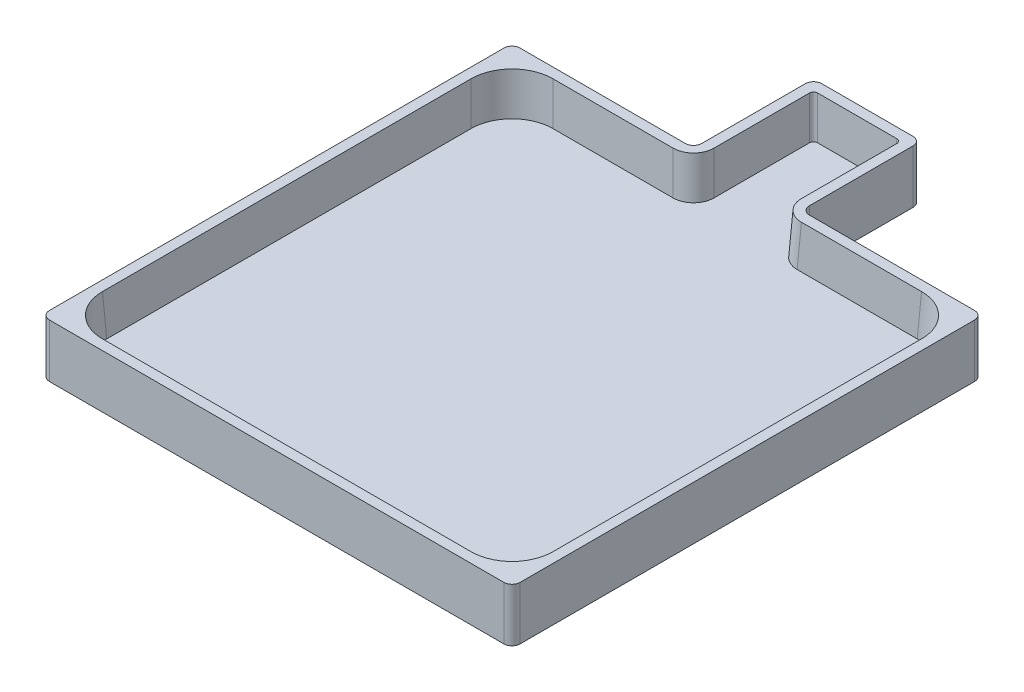
ISO-10303-21;
HEADER;
FILE_DESCRIPTION(('STEP AP214'),'2;1');
FILE_NAME('part.step','',(''),(''),'','','');
FILE_SCHEMA(('AUTOMOTIVE_DESIGN { 1 0 10303 214 1 1 1 1 }'));
ENDSEC;
DATA;
#1=APPLICATION_CONTEXT('core data for automotive mechanical design processes');
#2=APPLICATION_PROTOCOL_DEFINITION('international standard','automotive_design',2000,#1);
#3=PRODUCT_CONTEXT('',#1,'mechanical');
#4=PRODUCT('Part','Part','',(#3));
#5=PRODUCT_RELATED_PRODUCT_CATEGORY('part','',(#4));
#6=PRODUCT_DEFINITION_FORMATION('','',#4);
#7=PRODUCT_DEFINITION_CONTEXT('part definition',#1,'design');
#8=PRODUCT_DEFINITION('design','',#6,#7);
#9=PRODUCT_DEFINITION_SHAPE('','',#8);
#10=(LENGTH_UNIT() NAMED_UNIT(*) SI_UNIT(.MILLI.,.METRE.));
#11=(NAMED_UNIT(*) PLANE_ANGLE_UNIT() SI_UNIT($,.RADIAN.));
#12=(NAMED_UNIT(*) SI_UNIT($,.STERADIAN.) SOLID_ANGLE_UNIT());
#13=UNCERTAINTY_MEASURE_WITH_UNIT(LENGTH_MEASURE(1.E-05),#10,'distance_accuracy_value','');
#14=(GEOMETRIC_REPRESENTATION_CONTEXT(3) GLOBAL_UNCERTAINTY_ASSIGNED_CONTEXT((#13)) GLOBAL_UNIT_ASSIGNED_CONTEXT((#10,
#11,#12)) REPRESENTATION_CONTEXT('',''));
#15=CARTESIAN_POINT('',(0.,0.,0.));
#16=DIRECTION('',(0.,0.,1.));
#17=DIRECTION('',(1.,0.,0.));
#18=AXIS2_PLACEMENT_3D('',#15,#16,#17);
#19=CARTESIAN_POINT('',(-57.4,3.,0.));
#20=DIRECTION('',(1.,0.,0.));
#21=DIRECTION('',(0.,0.,-1.));
#22=AXIS2_PLACEMENT_3D('',#19,#20,#21);
#23=PLANE('',#22);
#24=DIRECTION('',(0.,0.,-1.));
#25=VECTOR('',#24,1.);
#26=CARTESIAN_POINT('',(-57.4,13.,0.));
#27=LINE('',#26,#25);
#28=CARTESIAN_POINT('',(-57.4,13.,55.4));
#29=VERTEX_POINT('',#28);
#30=CARTESIAN_POINT('',(-57.3999999999999,13.,-55.4));
#31=VERTEX_POINT('',#30);
#32=EDGE_CURVE('E484',#29,#31,#27,.T.);
#33=ORIENTED_EDGE('',*,*,#32,.T.);
#34=DIRECTION('',(0.,-1.,0.));
#35=VECTOR('',#34,1.);
#36=CARTESIAN_POINT('',(-57.4,3.,-55.4));
#37=LINE('',#36,#35);
#38=CARTESIAN_POINT('',(-57.4,0.,-55.4));
#39=VERTEX_POINT('',#38);
#40=EDGE_CURVE('E331',#31,#39,#37,.T.);
#41=ORIENTED_EDGE('',*,*,#40,.T.);
#42=DIRECTION('',(0.,0.,1.));
#43=VECTOR('',#42,1.);
#44=CARTESIAN_POINT('',(-57.4,0.,0.));
#45=LINE('',#44,#43);
#46=CARTESIAN_POINT('',(-57.4,0.,55.4));
#47=VERTEX_POINT('',#46);
#48=EDGE_CURVE('E487',#39,#47,#45,.T.);
#49=ORIENTED_EDGE('',*,*,#48,.T.);
#50=DIRECTION('',(0.,-1.,0.));
#51=VECTOR('',#50,1.);
#52=CARTESIAN_POINT('',(-57.4,3.,55.4));
#53=LINE('',#52,#51);
#54=EDGE_CURVE('E329',#47,#29,#53,.F.);
#55=ORIENTED_EDGE('',*,*,#54,.T.);
#56=EDGE_LOOP('',(#33,#41,#49,#55));
#57=FACE_BOUND('',#56,.T.);
#58=ADVANCED_FACE('F44',(#57),#23,.F.);
#59=CARTESIAN_POINT('',(-1.5318942695549E-13,3.,57.4000000000001));
#60=DIRECTION('',(0.,0.,-1.));
#61=DIRECTION('',(-1.,0.,0.));
#62=AXIS2_PLACEMENT_3D('',#59,#60,#61);
#63=PLANE('',#62);
#64=DIRECTION('',(1.,0.,0.));
#65=VECTOR('',#64,1.);
#66=CARTESIAN_POINT('',(-1.5318942695549E-13,0.,57.4000000000001));
#67=LINE('',#66,#65);
#68=CARTESIAN_POINT('',(-55.4,0.,57.4));
#69=VERTEX_POINT('',#68);
#70=CARTESIAN_POINT('',(55.4,0.,57.4000000000003));
#71=VERTEX_POINT('',#70);
#72=EDGE_CURVE('E490',#69,#71,#67,.T.);
#73=ORIENTED_EDGE('',*,*,#72,.T.);
#74=DIRECTION('',(0.,-1.,0.));
#75=VECTOR('',#74,1.);
#76=CARTESIAN_POINT('',(55.4,13.,57.4000000000003));
#77=LINE('',#76,#75);
#78=CARTESIAN_POINT('',(55.4,13.,57.4));
#79=VERTEX_POINT('',#78);
#80=EDGE_CURVE('E342',#71,#79,#77,.F.);
#81=ORIENTED_EDGE('',*,*,#80,.T.);
#82=DIRECTION('',(-1.,0.,0.));
#83=VECTOR('',#82,1.);
#84=CARTESIAN_POINT('',(1.22551541564393E-13,13.,57.4000000000001));
#85=LINE('',#84,#83);
#86=CARTESIAN_POINT('',(-55.4,13.,57.4000000000002));
#87=VERTEX_POINT('',#86);
#88=EDGE_CURVE('E481',#79,#87,#85,.T.);
#89=ORIENTED_EDGE('',*,*,#88,.T.);
#90=DIRECTION('',(0.,-1.,0.));
#91=VECTOR('',#90,1.);
#92=CARTESIAN_POINT('',(-55.4,3.,57.4));
#93=LINE('',#92,#91);
#94=EDGE_CURVE('E339',#87,#69,#93,.T.);
#95=ORIENTED_EDGE('',*,*,#94,.T.);
#96=EDGE_LOOP('',(#73,#81,#89,#95));
#97=FACE_BOUND('',#96,.T.);
#98=ADVANCED_FACE('F572',(#97),#63,.F.);
#99=CARTESIAN_POINT('',(57.4000000000001,3.,0.));
#100=DIRECTION('',(1.,0.,0.));
#101=DIRECTION('',(0.,0.,-1.));
#102=AXIS2_PLACEMENT_3D('',#99,#100,#101);
#103=PLANE('',#102);
#104=DIRECTION('',(0.,0.,1.));
#105=VECTOR('',#104,1.);
#106=CARTESIAN_POINT('',(57.4000000000001,0.,0.));
#107=LINE('',#106,#105);
#108=CARTESIAN_POINT('',(57.4000000000001,0.,-55.4));
#109=VERTEX_POINT('',#108);
#110=CARTESIAN_POINT('',(57.4,0.,55.4000000000003));
#111=VERTEX_POINT('',#110);
#112=EDGE_CURVE('E493',#109,#111,#107,.T.);
#113=ORIENTED_EDGE('',*,*,#112,.F.);
#114=DIRECTION('',(0.,-1.,0.));
#115=VECTOR('',#114,1.);
#116=CARTESIAN_POINT('',(57.4000000000001,13.,-55.4));
#117=LINE('',#116,#115);
#118=CARTESIAN_POINT('',(57.4,13.,-55.4));
#119=VERTEX_POINT('',#118);
#120=EDGE_CURVE('E337',#109,#119,#117,.F.);
#121=ORIENTED_EDGE('',*,*,#120,.T.);
#122=DIRECTION('',(0.,0.,1.));
#123=VECTOR('',#122,1.);
#124=CARTESIAN_POINT('',(57.4,13.,0.));
#125=LINE('',#124,#123);
#126=CARTESIAN_POINT('',(57.4,13.,55.4000000000003));
#127=VERTEX_POINT('',#126);
#128=EDGE_CURVE('E478',#119,#127,#125,.T.);
#129=ORIENTED_EDGE('',*,*,#128,.T.);
#130=DIRECTION('',(0.,-1.,0.));
#131=VECTOR('',#130,1.);
#132=CARTESIAN_POINT('',(57.4,0.,55.4000000000003));
#133=LINE('',#132,#131);
#134=EDGE_CURVE('E334',#127,#111,#133,.T.);
#135=ORIENTED_EDGE('',*,*,#134,.T.);
#136=EDGE_LOOP('',(#113,#121,#129,#135));
#137=FACE_BOUND('',#136,.T.);
#138=ADVANCED_FACE('F577',(#137),#103,.T.);
#139=CARTESIAN_POINT('',(0.,3.,-57.4000000000001));
#140=DIRECTION('',(0.,0.,1.));
#141=DIRECTION('',(1.,0.,0.));
#142=AXIS2_PLACEMENT_3D('',#139,#140,#141);
#143=PLANE('',#142);
#144=DIRECTION('',(-1.,0.,0.));
#145=VECTOR('',#144,1.);
#146=CARTESIAN_POINT('',(0.,0.,-57.4000000000001));
#147=LINE('',#146,#145);
#148=CARTESIAN_POINT('',(55.4000000000001,0.,-57.4));
#149=VERTEX_POINT('',#148);
#150=CARTESIAN_POINT('',(15.1370570403103,0.,-57.4000000000001));
#151=VERTEX_POINT('',#150);
#152=EDGE_CURVE('E276',#149,#151,#147,.T.);
#153=ORIENTED_EDGE('',*,*,#152,.T.);
#154=DIRECTION('',(0.,-1.,0.));
#155=VECTOR('',#154,1.);
#156=CARTESIAN_POINT('',(15.1370570403103,3.,-57.4000000000001));
#157=LINE('',#156,#155);
#158=CARTESIAN_POINT('',(15.1370570403103,13.,-57.4));
#159=VERTEX_POINT('',#158);
#160=EDGE_CURVE('E294',#151,#159,#157,.F.);
#161=ORIENTED_EDGE('',*,*,#160,.T.);
#162=DIRECTION('',(1.,0.,0.));
#163=VECTOR('',#162,1.);
#164=CARTESIAN_POINT('',(0.,13.,-57.4));
#165=LINE('',#164,#163);
#166=CARTESIAN_POINT('',(55.4000000000001,13.,-57.4));
#167=VERTEX_POINT('',#166);
#168=EDGE_CURVE('E475',#159,#167,#165,.T.);
#169=ORIENTED_EDGE('',*,*,#168,.T.);
#170=DIRECTION('',(0.,-1.,0.));
#171=VECTOR('',#170,1.);
#172=CARTESIAN_POINT('',(55.4000000000001,0.,-57.4));
#173=LINE('',#172,#171);
#174=EDGE_CURVE('E283',#167,#149,#173,.T.);
#175=ORIENTED_EDGE('',*,*,#174,.T.);
#176=EDGE_LOOP('',(#153,#161,#169,#175));
#177=FACE_BOUND('',#176,.T.);
#178=ADVANCED_FACE('F860',(#177),#143,.F.);
#179=CARTESIAN_POINT('',(13.1370570403103,3.,0.));
#180=DIRECTION('',(1.,0.,0.));
#181=DIRECTION('',(0.,0.,-1.));
#182=AXIS2_PLACEMENT_3D('',#179,#180,#181);
#183=PLANE('',#182);
#184=DIRECTION('',(0.,0.,1.));
#185=VECTOR('',#184,1.);
#186=CARTESIAN_POINT('',(13.1370570403103,13.,0.));
#187=LINE('',#186,#185);
#188=CARTESIAN_POINT('',(13.1370570403103,13.,-84.6627718809242));
#189=VERTEX_POINT('',#188);
#190=CARTESIAN_POINT('',(13.1370570403103,13.,-59.4000000000001));
#191=VERTEX_POINT('',#190);
#192=EDGE_CURVE('E473',#189,#191,#187,.T.);
#193=ORIENTED_EDGE('',*,*,#192,.T.);
#194=DIRECTION('',(0.,-1.,0.));
#195=VECTOR('',#194,1.);
#196=CARTESIAN_POINT('',(13.1370570403103,3.,-59.4000000000001));
#197=LINE('',#196,#195);
#198=CARTESIAN_POINT('',(13.1370570403103,0.,-59.4000000000001));
#199=VERTEX_POINT('',#198);
#200=EDGE_CURVE('E275',#191,#199,#197,.T.);
#201=ORIENTED_EDGE('',*,*,#200,.T.);
#202=DIRECTION('',(0.,0.,1.));
#203=VECTOR('',#202,1.);
#204=CARTESIAN_POINT('',(13.1370570403103,0.,0.));
#205=LINE('',#204,#203);
#206=CARTESIAN_POINT('',(13.1370570403103,0.,-84.6627718809242));
#207=VERTEX_POINT('',#206);
#208=EDGE_CURVE('E258',#207,#199,#205,.T.);
#209=ORIENTED_EDGE('',*,*,#208,.F.);
#210=DIRECTION('',(0.,-1.,0.));
#211=VECTOR('',#210,1.);
#212=CARTESIAN_POINT('',(13.1370570403103,13.,-84.6627718809242));
#213=LINE('',#212,#211);
#214=EDGE_CURVE('E272',#207,#189,#213,.F.);
#215=ORIENTED_EDGE('',*,*,#214,.T.);
#216=EDGE_LOOP('',(#193,#201,#209,#215));
#217=FACE_BOUND('',#216,.T.);
#218=ADVANCED_FACE('F271',(#217),#183,.T.);
#219=CARTESIAN_POINT('',(0.,3.,-86.6627718809242));
#220=DIRECTION('',(0.,0.,1.));
#221=DIRECTION('',(1.,0.,0.));
#222=AXIS2_PLACEMENT_3D('',#219,#220,#221);
#223=PLANE('',#222);
#224=DIRECTION('',(-1.,0.,0.));
#225=VECTOR('',#224,1.);
#226=CARTESIAN_POINT('',(0.,0.,-86.6627718809242));
#227=LINE('',#226,#225);
#228=CARTESIAN_POINT('',(11.1370570403103,0.,-86.6627718809242));
#229=VERTEX_POINT('',#228);
#230=CARTESIAN_POINT('',(-11.1370570403103,0.,-86.6627718809242));
#231=VERTEX_POINT('',#230);
#232=EDGE_CURVE('E260',#229,#231,#227,.T.);
#233=ORIENTED_EDGE('',*,*,#232,.T.);
#234=DIRECTION('',(0.,-1.,0.));
#235=VECTOR('',#234,1.);
#236=CARTESIAN_POINT('',(-11.1370570403103,3.,-86.6627718809242));
#237=LINE('',#236,#235);
#238=CARTESIAN_POINT('',(-11.1370570403103,13.,-86.6627718809242));
#239=VERTEX_POINT('',#238);
#240=EDGE_CURVE('E311',#231,#239,#237,.F.);
#241=ORIENTED_EDGE('',*,*,#240,.T.);
#242=DIRECTION('',(1.,0.,0.));
#243=VECTOR('',#242,1.);
#244=CARTESIAN_POINT('',(0.,13.,-86.6627718809242));
#245=LINE('',#244,#243);
#246=CARTESIAN_POINT('',(11.1370570403103,13.,-86.6627718809242));
#247=VERTEX_POINT('',#246);
#248=EDGE_CURVE('E470',#239,#247,#245,.T.);
#249=ORIENTED_EDGE('',*,*,#248,.T.);
#250=DIRECTION('',(0.,-1.,0.));
#251=VECTOR('',#250,1.);
#252=CARTESIAN_POINT('',(11.1370570403103,0.,-86.6627718809242));
#253=LINE('',#252,#251);
#254=EDGE_CURVE('E309',#247,#229,#253,.T.);
#255=ORIENTED_EDGE('',*,*,#254,.T.);
#256=EDGE_LOOP('',(#233,#241,#249,#255));
#257=FACE_BOUND('',#256,.T.);
#258=ADVANCED_FACE('F847',(#257),#223,.F.);
#259=CARTESIAN_POINT('',(-13.1370570403103,3.,0.));
#260=DIRECTION('',(1.,0.,0.));
#261=DIRECTION('',(0.,0.,-1.));
#262=AXIS2_PLACEMENT_3D('',#259,#260,#261);
#263=PLANE('',#262);
#264=DIRECTION('',(0.,0.,-1.));
#265=VECTOR('',#264,1.);
#266=CARTESIAN_POINT('',(-13.1370570403103,13.,0.));
#267=LINE('',#266,#265);
#268=CARTESIAN_POINT('',(-13.1370570403103,13.,-59.4));
#269=VERTEX_POINT('',#268);
#270=CARTESIAN_POINT('',(-13.1370570403103,13.,-84.6627718809242));
#271=VERTEX_POINT('',#270);
#272=EDGE_CURVE('E467',#269,#271,#267,.T.);
#273=ORIENTED_EDGE('',*,*,#272,.T.);
#274=DIRECTION('',(0.,-1.,0.));
#275=VECTOR('',#274,1.);
#276=CARTESIAN_POINT('',(-13.1370570403103,3.,-84.6627718809242));
#277=LINE('',#276,#275);
#278=CARTESIAN_POINT('',(-13.1370570403103,0.,-84.6627718809242));
#279=VERTEX_POINT('',#278);
#280=EDGE_CURVE('E298',#271,#279,#277,.T.);
#281=ORIENTED_EDGE('',*,*,#280,.T.);
#282=DIRECTION('',(0.,0.,1.));
#283=VECTOR('',#282,1.);
#284=CARTESIAN_POINT('',(-13.1370570403103,0.,0.));
#285=LINE('',#284,#283);
#286=CARTESIAN_POINT('',(-13.1370570403103,0.,-59.4));
#287=VERTEX_POINT('',#286);
#288=EDGE_CURVE('E286',#279,#287,#285,.T.);
#289=ORIENTED_EDGE('',*,*,#288,.T.);
#290=DIRECTION('',(0.,-1.,0.));
#291=VECTOR('',#290,1.);
#292=CARTESIAN_POINT('',(-13.1370570403103,13.,-59.4));
#293=LINE('',#292,#291);
#294=EDGE_CURVE('E296',#287,#269,#293,.F.);
#295=ORIENTED_EDGE('',*,*,#294,.T.);
#296=EDGE_LOOP('',(#273,#281,#289,#295));
#297=FACE_BOUND('',#296,.T.);
#298=ADVANCED_FACE('F840',(#297),#263,.F.);
#299=CARTESIAN_POINT('',(0.,3.,-57.4));
#300=DIRECTION('',(0.,0.,1.));
#301=DIRECTION('',(1.,0.,0.));
#302=AXIS2_PLACEMENT_3D('',#299,#300,#301);
#303=PLANE('',#302);
#304=DIRECTION('',(1.,0.,0.));
#305=VECTOR('',#304,1.);
#306=CARTESIAN_POINT('',(0.,13.,-57.4));
#307=LINE('',#306,#305);
#308=CARTESIAN_POINT('',(-55.4,13.,-57.4));
#309=VERTEX_POINT('',#308);
#310=CARTESIAN_POINT('',(-15.1370570403103,13.,-57.4));
#311=VERTEX_POINT('',#310);
#312=EDGE_CURVE('E464',#309,#311,#307,.T.);
#313=ORIENTED_EDGE('',*,*,#312,.T.);
#314=DIRECTION('',(0.,-1.,0.));
#315=VECTOR('',#314,1.);
#316=CARTESIAN_POINT('',(-15.1370570403103,0.,-57.4));
#317=LINE('',#316,#315);
#318=CARTESIAN_POINT('',(-15.1370570403103,0.,-57.4));
#319=VERTEX_POINT('',#318);
#320=EDGE_CURVE('E326',#311,#319,#317,.T.);
#321=ORIENTED_EDGE('',*,*,#320,.T.);
#322=DIRECTION('',(-1.,0.,0.));
#323=VECTOR('',#322,1.);
#324=CARTESIAN_POINT('',(0.,0.,-57.4));
#325=LINE('',#324,#323);
#326=CARTESIAN_POINT('',(-55.4,0.,-57.4));
#327=VERTEX_POINT('',#326);
#328=EDGE_CURVE('E281',#319,#327,#325,.T.);
#329=ORIENTED_EDGE('',*,*,#328,.T.);
#330=DIRECTION('',(0.,-1.,0.));
#331=VECTOR('',#330,1.);
#332=CARTESIAN_POINT('',(-55.4,3.,-57.4));
#333=LINE('',#332,#331);
#334=EDGE_CURVE('E324',#327,#309,#333,.F.);
#335=ORIENTED_EDGE('',*,*,#334,.T.);
#336=EDGE_LOOP('',(#313,#321,#329,#335));
#337=FACE_BOUND('',#336,.T.);
#338=ADVANCED_FACE('F834',(#337),#303,.F.);
#339=CARTESIAN_POINT('',(0.,0.,0.));
#340=DIRECTION('',(0.,1.,0.));
#341=DIRECTION('',(0.,0.,1.));
#342=AXIS2_PLACEMENT_3D('',#339,#340,#341);
#343=PLANE('',#342);
#344=ORIENTED_EDGE('',*,*,#288,.F.);
#345=CARTESIAN_POINT('',(-11.1370570403103,0.,-84.6627718809242));
#346=DIRECTION('',(0.,1.,0.));
#347=DIRECTION('',(0.,0.,1.));
#348=AXIS2_PLACEMENT_3D('',#345,#346,#347);
#349=CIRCLE('',#348,2.);
#350=EDGE_CURVE('E307',#279,#231,#349,.F.);
#351=ORIENTED_EDGE('',*,*,#350,.T.);
#352=ORIENTED_EDGE('',*,*,#232,.F.);
#353=CARTESIAN_POINT('',(11.1370570403103,0.,-84.6627718809242));
#354=DIRECTION('',(0.,1.,0.));
#355=DIRECTION('',(0.,0.,1.));
#356=AXIS2_PLACEMENT_3D('',#353,#354,#355);
#357=CIRCLE('',#356,2.);
#358=EDGE_CURVE('E254',#229,#207,#357,.F.);
#359=ORIENTED_EDGE('',*,*,#358,.T.);
#360=ORIENTED_EDGE('',*,*,#208,.T.);
#361=CARTESIAN_POINT('',(15.1370570403103,0.,-59.4000000000001));
#362=DIRECTION('',(0.,1.,0.));
#363=DIRECTION('',(0.,0.,1.));
#364=AXIS2_PLACEMENT_3D('',#361,#362,#363);
#365=CIRCLE('',#364,2.);
#366=EDGE_CURVE('E344',#199,#151,#365,.T.);
#367=ORIENTED_EDGE('',*,*,#366,.T.);
#368=ORIENTED_EDGE('',*,*,#152,.F.);
#369=CARTESIAN_POINT('',(55.4000000000001,0.,-55.4));
#370=DIRECTION('',(0.,1.,0.));
#371=DIRECTION('',(0.,0.,1.));
#372=AXIS2_PLACEMENT_3D('',#369,#370,#371);
#373=CIRCLE('',#372,2.);
#374=EDGE_CURVE('E266',#149,#109,#373,.F.);
#375=ORIENTED_EDGE('',*,*,#374,.T.);
#376=ORIENTED_EDGE('',*,*,#112,.T.);
#377=CARTESIAN_POINT('',(55.4,0.,55.4000000000003));
#378=DIRECTION('',(0.,1.,0.));
#379=DIRECTION('',(0.,0.,1.));
#380=AXIS2_PLACEMENT_3D('',#377,#378,#379);
#381=CIRCLE('',#380,2.);
#382=EDGE_CURVE('E303',#111,#71,#381,.F.);
#383=ORIENTED_EDGE('',*,*,#382,.T.);
#384=ORIENTED_EDGE('',*,*,#72,.F.);
#385=CARTESIAN_POINT('',(-55.4,0.,55.4));
#386=DIRECTION('',(0.,1.,0.));
#387=DIRECTION('',(0.,0.,1.));
#388=AXIS2_PLACEMENT_3D('',#385,#386,#387);
#389=CIRCLE('',#388,2.);
#390=EDGE_CURVE('E301',#69,#47,#389,.F.);
#391=ORIENTED_EDGE('',*,*,#390,.T.);
#392=ORIENTED_EDGE('',*,*,#48,.F.);
#393=CARTESIAN_POINT('',(-55.4,0.,-55.4));
#394=DIRECTION('',(0.,1.,0.));
#395=DIRECTION('',(0.,0.,1.));
#396=AXIS2_PLACEMENT_3D('',#393,#394,#395);
#397=CIRCLE('',#396,2.);
#398=EDGE_CURVE('E265',#39,#327,#397,.F.);
#399=ORIENTED_EDGE('',*,*,#398,.T.);
#400=ORIENTED_EDGE('',*,*,#328,.F.);
#401=CARTESIAN_POINT('',(-15.1370570403103,0.,-59.4));
#402=DIRECTION('',(0.,1.,0.));
#403=DIRECTION('',(0.,0.,1.));
#404=AXIS2_PLACEMENT_3D('',#401,#402,#403);
#405=CIRCLE('',#404,2.);
#406=EDGE_CURVE('E348',#319,#287,#405,.T.);
#407=ORIENTED_EDGE('',*,*,#406,.T.);
#408=EDGE_LOOP('',(#344,#351,#352,#359,#360,#367,#368,#375,#376,#383,#384,#391,#392,#399,#400,#407));
#409=FACE_BOUND('',#408,.T.);
#410=ADVANCED_FACE('F257',(#409),#343,.F.);
#411=CARTESIAN_POINT('',(0.,13.,0.));
#412=DIRECTION('',(0.,1.,0.));
#413=DIRECTION('',(0.,0.,1.));
#414=AXIS2_PLACEMENT_3D('',#411,#412,#413);
#415=PLANE('',#414);
#416=DIRECTION('',(-1.,0.,0.));
#417=VECTOR('',#416,1.);
#418=CARTESIAN_POINT('',(0.,13.,-84.1868496737546));
#419=LINE('',#418,#417);
#420=CARTESIAN_POINT('',(-9.66250529838616,13.,-84.1868496737546));
#421=VERTEX_POINT('',#420);
#422=CARTESIAN_POINT('',(9.66250529838616,13.,-84.1868496737546));
#423=VERTEX_POINT('',#422);
#424=EDGE_CURVE('E426',#421,#423,#419,.F.);
#425=ORIENTED_EDGE('',*,*,#424,.T.);
#426=CARTESIAN_POINT('',(9.65976248714282,13.,-83.1854773277567));
#427=DIRECTION('',(0.,1.,0.));
#428=DIRECTION('',(0.707106781186548,0.,-0.707106781186548));
#429=AXIS2_PLACEMENT_3D('',#426,#427,#428);
#430=ELLIPSE('',#429,1.00274281381557,1.);
#431=CARTESIAN_POINT('',(10.6611348331407,13.,-83.188220139));
#432=VERTEX_POINT('',#431);
#433=EDGE_CURVE('E11',#423,#432,#430,.F.);
#434=ORIENTED_EDGE('',*,*,#433,.T.);
#435=DIRECTION('',(0.,0.,-1.));
#436=VECTOR('',#435,1.);
#437=CARTESIAN_POINT('',(10.6611348331407,13.,0.));
#438=LINE('',#437,#436);
#439=CARTESIAN_POINT('',(10.6611348331407,13.,-59.9172254666033));
#440=VERTEX_POINT('',#439);
#441=EDGE_CURVE('E435',#432,#440,#438,.F.);
#442=ORIENTED_EDGE('',*,*,#441,.T.);
#443=CARTESIAN_POINT('',(15.6679965631303,13.,-59.9309395228201));
#444=DIRECTION('',(0.,1.,0.));
#445=DIRECTION('',(-0.707106781186548,0.,0.707106781186547));
#446=AXIS2_PLACEMENT_3D('',#443,#444,#445);
#447=ELLIPSE('',#446,5.01371406907783,5.);
#448=CARTESIAN_POINT('',(15.6542825069136,13.,-54.9240777928304));
#449=VERTEX_POINT('',#448);
#450=EDGE_CURVE('E398',#440,#449,#447,.T.);
#451=ORIENTED_EDGE('',*,*,#450,.T.);
#452=DIRECTION('',(-1.,0.,0.));
#453=VECTOR('',#452,1.);
#454=CARTESIAN_POINT('',(0.,13.,-54.9240777928305));
#455=LINE('',#454,#453);
#456=CARTESIAN_POINT('',(44.9377824452848,13.,-54.9240777928304));
#457=VERTEX_POINT('',#456);
#458=EDGE_CURVE('E503',#449,#457,#455,.F.);
#459=ORIENTED_EDGE('',*,*,#458,.T.);
#460=CARTESIAN_POINT('',(44.9103543328513,13.,-44.9103543328512));
#461=DIRECTION('',(0.,1.,0.));
#462=DIRECTION('',(0.707106781186548,0.,-0.707106781186547));
#463=AXIS2_PLACEMENT_3D('',#460,#461,#462);
#464=ELLIPSE('',#463,10.0274281381557,10.);
#465=CARTESIAN_POINT('',(54.9240777928305,13.,-44.9377824452847));
#466=VERTEX_POINT('',#465);
#467=EDGE_CURVE('E386',#457,#466,#464,.F.);
#468=ORIENTED_EDGE('',*,*,#467,.T.);
#469=DIRECTION('',(0.,0.,-1.));
#470=VECTOR('',#469,1.);
#471=CARTESIAN_POINT('',(54.9240777928305,13.,0.));
#472=LINE('',#471,#470);
#473=CARTESIAN_POINT('',(54.9240777928304,13.,44.9377824452851));
#474=VERTEX_POINT('',#473);
#475=EDGE_CURVE('E505',#466,#474,#472,.F.);
#476=ORIENTED_EDGE('',*,*,#475,.T.);
#477=CARTESIAN_POINT('',(44.9103543328512,13.,44.9103543328516));
#478=DIRECTION('',(0.,1.,0.));
#479=DIRECTION('',(0.707106781186546,0.,0.707106781186549));
#480=AXIS2_PLACEMENT_3D('',#477,#478,#479);
#481=ELLIPSE('',#480,10.0274281381557,10.);
#482=CARTESIAN_POINT('',(44.9377824452846,13.,54.9240777928308));
#483=VERTEX_POINT('',#482);
#484=EDGE_CURVE('E384',#474,#483,#481,.F.);
#485=ORIENTED_EDGE('',*,*,#484,.T.);
#486=DIRECTION('',(1.,0.,0.));
#487=VECTOR('',#486,1.);
#488=CARTESIAN_POINT('',(-2.28667409144639E-13,13.,54.9240777928306));
#489=LINE('',#488,#487);
#490=CARTESIAN_POINT('',(-44.9377824452847,13.,54.9240777928304));
#491=VERTEX_POINT('',#490);
#492=EDGE_CURVE('E508',#483,#491,#489,.F.);
#493=ORIENTED_EDGE('',*,*,#492,.T.);
#494=CARTESIAN_POINT('',(-44.9103543328512,13.,44.9103543328512));
#495=DIRECTION('',(0.,1.,0.));
#496=DIRECTION('',(-0.707106781186549,0.,0.707106781186546));
#497=AXIS2_PLACEMENT_3D('',#494,#495,#496);
#498=ELLIPSE('',#497,10.0274281381557,10.);
#499=CARTESIAN_POINT('',(-54.9240777928304,13.,44.9377824452847));
#500=VERTEX_POINT('',#499);
#501=EDGE_CURVE('E382',#491,#500,#498,.F.);
#502=ORIENTED_EDGE('',*,*,#501,.T.);
#503=DIRECTION('',(0.,0.,1.));
#504=VECTOR('',#503,1.);
#505=CARTESIAN_POINT('',(-54.9240777928304,13.,0.));
#506=LINE('',#505,#504);
#507=CARTESIAN_POINT('',(-54.9240777928304,13.,-44.9377824452847));
#508=VERTEX_POINT('',#507);
#509=EDGE_CURVE('E510',#500,#508,#506,.F.);
#510=ORIENTED_EDGE('',*,*,#509,.T.);
#511=CARTESIAN_POINT('',(-44.9103543328512,13.,-44.9103543328512));
#512=DIRECTION('',(0.,1.,0.));
#513=DIRECTION('',(-0.707106781186548,0.,-0.707106781186548));
#514=AXIS2_PLACEMENT_3D('',#511,#512,#513);
#515=ELLIPSE('',#514,10.0274281381557,10.);
#516=CARTESIAN_POINT('',(-44.9377824452847,13.,-54.9240777928304));
#517=VERTEX_POINT('',#516);
#518=EDGE_CURVE('E388',#508,#517,#515,.F.);
#519=ORIENTED_EDGE('',*,*,#518,.T.);
#520=DIRECTION('',(-1.,0.,0.));
#521=VECTOR('',#520,1.);
#522=CARTESIAN_POINT('',(0.,13.,-54.9240777928304));
#523=LINE('',#522,#521);
#524=CARTESIAN_POINT('',(-15.6542825069136,13.,-54.9240777928304));
#525=VERTEX_POINT('',#524);
#526=EDGE_CURVE('E289',#517,#525,#523,.F.);
#527=ORIENTED_EDGE('',*,*,#526,.T.);
#528=CARTESIAN_POINT('',(-15.6679965631303,13.,-59.93093952282));
#529=DIRECTION('',(0.,1.,0.));
#530=DIRECTION('',(0.707106781186548,0.,0.707106781186548));
#531=AXIS2_PLACEMENT_3D('',#528,#529,#530);
#532=ELLIPSE('',#531,5.01371406907783,5.);
#533=CARTESIAN_POINT('',(-10.6611348331407,13.,-59.9172254666033));
#534=VERTEX_POINT('',#533);
#535=EDGE_CURVE('E396',#525,#534,#532,.T.);
#536=ORIENTED_EDGE('',*,*,#535,.T.);
#537=DIRECTION('',(0.,0.,1.));
#538=VECTOR('',#537,1.);
#539=CARTESIAN_POINT('',(-10.6611348331407,13.,0.));
#540=LINE('',#539,#538);
#541=CARTESIAN_POINT('',(-10.6611348331407,13.,-83.188220139));
#542=VERTEX_POINT('',#541);
#543=EDGE_CURVE('E427',#534,#542,#540,.F.);
#544=ORIENTED_EDGE('',*,*,#543,.T.);
#545=CARTESIAN_POINT('',(-9.65976248714281,13.,-83.1854773277567));
#546=DIRECTION('',(0.,1.,0.));
#547=DIRECTION('',(-0.707106781186548,0.,-0.707106781186548));
#548=AXIS2_PLACEMENT_3D('',#545,#546,#547);
#549=ELLIPSE('',#548,1.00274281381557,1.);
#550=EDGE_CURVE('E52',#542,#421,#549,.F.);
#551=ORIENTED_EDGE('',*,*,#550,.T.);
#552=EDGE_LOOP('',(#425,#434,#442,#451,#459,#468,#476,#485,#493,#502,#510,#519,#527,#536,#544,#551));
#553=FACE_BOUND('',#552,.T.);
#554=ORIENTED_EDGE('',*,*,#248,.F.);
#555=CARTESIAN_POINT('',(-11.1370570403103,13.,-84.6627718809242));
#556=DIRECTION('',(0.,1.,0.));
#557=DIRECTION('',(0.,0.,1.));
#558=AXIS2_PLACEMENT_3D('',#555,#556,#557);
#559=CIRCLE('',#558,2.);
#560=EDGE_CURVE('E322',#239,#271,#559,.T.);
#561=ORIENTED_EDGE('',*,*,#560,.T.);
#562=ORIENTED_EDGE('',*,*,#272,.F.);
#563=CARTESIAN_POINT('',(-15.1370570403103,13.,-59.4));
#564=DIRECTION('',(0.,1.,0.));
#565=DIRECTION('',(0.,0.,1.));
#566=AXIS2_PLACEMENT_3D('',#563,#564,#565);
#567=CIRCLE('',#566,2.);
#568=EDGE_CURVE('E350',#269,#311,#567,.F.);
#569=ORIENTED_EDGE('',*,*,#568,.T.);
#570=ORIENTED_EDGE('',*,*,#312,.F.);
#571=CARTESIAN_POINT('',(-55.4,13.,-55.4));
#572=DIRECTION('',(0.,1.,0.));
#573=DIRECTION('',(0.,0.,1.));
#574=AXIS2_PLACEMENT_3D('',#571,#572,#573);
#575=CIRCLE('',#574,2.);
#576=EDGE_CURVE('E320',#309,#31,#575,.T.);
#577=ORIENTED_EDGE('',*,*,#576,.T.);
#578=ORIENTED_EDGE('',*,*,#32,.F.);
#579=CARTESIAN_POINT('',(-55.4,13.,55.4));
#580=DIRECTION('',(0.,1.,0.));
#581=DIRECTION('',(0.,0.,1.));
#582=AXIS2_PLACEMENT_3D('',#579,#580,#581);
#583=CIRCLE('',#582,2.);
#584=EDGE_CURVE('E313',#29,#87,#583,.T.);
#585=ORIENTED_EDGE('',*,*,#584,.T.);
#586=ORIENTED_EDGE('',*,*,#88,.F.);
#587=CARTESIAN_POINT('',(55.4,13.,55.4000000000003));
#588=DIRECTION('',(0.,1.,0.));
#589=DIRECTION('',(0.,0.,1.));
#590=AXIS2_PLACEMENT_3D('',#587,#588,#589);
#591=CIRCLE('',#590,2.);
#592=EDGE_CURVE('E315',#79,#127,#591,.T.);
#593=ORIENTED_EDGE('',*,*,#592,.T.);
#594=ORIENTED_EDGE('',*,*,#128,.F.);
#595=CARTESIAN_POINT('',(55.4000000000001,13.,-55.4));
#596=DIRECTION('',(0.,1.,0.));
#597=DIRECTION('',(0.,0.,1.));
#598=AXIS2_PLACEMENT_3D('',#595,#596,#597);
#599=CIRCLE('',#598,2.);
#600=EDGE_CURVE('E317',#119,#167,#599,.T.);
#601=ORIENTED_EDGE('',*,*,#600,.T.);
#602=ORIENTED_EDGE('',*,*,#168,.F.);
#603=CARTESIAN_POINT('',(15.1370570403103,13.,-59.4000000000001));
#604=DIRECTION('',(0.,1.,0.));
#605=DIRECTION('',(0.,0.,1.));
#606=AXIS2_PLACEMENT_3D('',#603,#604,#605);
#607=CIRCLE('',#606,2.);
#608=EDGE_CURVE('E346',#159,#191,#607,.F.);
#609=ORIENTED_EDGE('',*,*,#608,.T.);
#610=ORIENTED_EDGE('',*,*,#192,.F.);
#611=CARTESIAN_POINT('',(11.1370570403103,13.,-84.6627718809242));
#612=DIRECTION('',(0.,1.,0.));
#613=DIRECTION('',(0.,0.,1.));
#614=AXIS2_PLACEMENT_3D('',#611,#612,#613);
#615=CIRCLE('',#614,2.);
#616=EDGE_CURVE('E280',#189,#247,#615,.T.);
#617=ORIENTED_EDGE('',*,*,#616,.T.);
#618=EDGE_LOOP('',(#554,#561,#562,#569,#570,#577,#578,#585,#586,#593,#594,#601,#602,#609,#610,#617));
#619=FACE_BOUND('',#618,.T.);
#620=ADVANCED_FACE('F424',(#553,#619),#415,.T.);
#621=CARTESIAN_POINT('',(0.,3.,-54.4));
#622=DIRECTION('',(0.,0.0523359562429439,0.998629534754574));
#623=DIRECTION('',(0.,-0.998629534754574,0.052335956242944));
#624=AXIS2_PLACEMENT_3D('',#621,#622,#623);
#625=PLANE('',#624);
#626=DIRECTION('',(1.,0.,0.));
#627=VECTOR('',#626,1.);
#628=CARTESIAN_POINT('',(0.,3.,-54.4));
#629=LINE('',#628,#627);
#630=CARTESIAN_POINT('',(-44.4137046524543,3.,-54.4));
#631=VERTEX_POINT('',#630);
#632=CARTESIAN_POINT('',(-15.1302047140832,3.,-54.4));
#633=VERTEX_POINT('',#632);
#634=EDGE_CURVE('E461',#631,#633,#629,.T.);
#635=ORIENTED_EDGE('',*,*,#634,.T.);
#636=DIRECTION('',(-0.0522644276887141,0.997264688634237,-0.052264427688714));
#637=VECTOR('',#636,1.);
#638=CARTESIAN_POINT('',(-15.0888754947156,2.21139151605021,-54.3586707806324));
#639=LINE('',#638,#637);
#640=EDGE_CURVE('E403',#633,#525,#639,.T.);
#641=ORIENTED_EDGE('',*,*,#640,.T.);
#642=ORIENTED_EDGE('',*,*,#526,.F.);
#643=DIRECTION('',(-0.0522644276887141,0.997264688634237,-0.052264427688714));
#644=VECTOR('',#643,1.);
#645=CARTESIAN_POINT('',(-44.4409829212476,3.52050037544916,-54.4272782687933));
#646=LINE('',#645,#644);
#647=EDGE_CURVE('E379',#517,#631,#646,.F.);
#648=ORIENTED_EDGE('',*,*,#647,.T.);
#649=EDGE_LOOP('',(#635,#641,#642,#648));
#650=FACE_BOUND('',#649,.T.);
#651=ADVANCED_FACE('F523',(#650),#625,.T.);
#652=CARTESIAN_POINT('',(-54.4,3.,0.));
#653=DIRECTION('',(0.998629534754574,0.0523359562429439,0.));
#654=DIRECTION('',(-0.052335956242944,0.998629534754574,0.));
#655=AXIS2_PLACEMENT_3D('',#652,#653,#654);
#656=PLANE('',#655);
#657=ORIENTED_EDGE('',*,*,#509,.F.);
#658=DIRECTION('',(-0.052264427688714,0.997264688634237,0.0522644276887138));
#659=VECTOR('',#658,1.);
#660=CARTESIAN_POINT('',(-54.4272782687933,3.52050037544915,44.4409829212476));
#661=LINE('',#660,#659);
#662=CARTESIAN_POINT('',(-54.4,3.,44.4137046524543));
#663=VERTEX_POINT('',#662);
#664=EDGE_CURVE('E354',#500,#663,#661,.F.);
#665=ORIENTED_EDGE('',*,*,#664,.T.);
#666=DIRECTION('',(0.,0.,-1.));
#667=VECTOR('',#666,1.);
#668=CARTESIAN_POINT('',(-54.4,3.,0.));
#669=LINE('',#668,#667);
#670=CARTESIAN_POINT('',(-54.4,3.,-44.4137046524543));
#671=VERTEX_POINT('',#670);
#672=EDGE_CURVE('E458',#663,#671,#669,.T.);
#673=ORIENTED_EDGE('',*,*,#672,.T.);
#674=DIRECTION('',(-0.052264427688714,0.997264688634237,-0.0522644276887141));
#675=VECTOR('',#674,1.);
#676=CARTESIAN_POINT('',(-54.9513560616237,13.5205003754492,-44.965060714078));
#677=LINE('',#676,#675);
#678=EDGE_CURVE('E352',#671,#508,#677,.T.);
#679=ORIENTED_EDGE('',*,*,#678,.T.);
#680=EDGE_LOOP('',(#657,#665,#673,#679));
#681=FACE_BOUND('',#680,.T.);
#682=ADVANCED_FACE('F529',(#681),#656,.T.);
#683=CARTESIAN_POINT('',(-2.26485497023532E-13,3.,54.4000000000002));
#684=DIRECTION('',(0.,0.0523359562429439,-0.998629534754574));
#685=DIRECTION('',(0.,0.998629534754574,0.052335956242944));
#686=AXIS2_PLACEMENT_3D('',#683,#684,#685);
#687=PLANE('',#686);
#688=DIRECTION('',(-1.,0.,0.));
#689=VECTOR('',#688,1.);
#690=CARTESIAN_POINT('',(-2.26485497023532E-13,3.,54.4000000000002));
#691=LINE('',#690,#689);
#692=CARTESIAN_POINT('',(44.4137046524542,3.,54.4000000000004));
#693=VERTEX_POINT('',#692);
#694=CARTESIAN_POINT('',(-44.4137046524543,3.,54.4));
#695=VERTEX_POINT('',#694);
#696=EDGE_CURVE('E455',#693,#695,#691,.T.);
#697=ORIENTED_EDGE('',*,*,#696,.T.);
#698=DIRECTION('',(-0.0522644276887141,0.997264688634237,0.0522644276887138));
#699=VECTOR('',#698,1.);
#700=CARTESIAN_POINT('',(-44.965060714078,13.5205003754492,54.9513560616237));
#701=LINE('',#700,#699);
#702=EDGE_CURVE('E369',#695,#491,#701,.T.);
#703=ORIENTED_EDGE('',*,*,#702,.T.);
#704=ORIENTED_EDGE('',*,*,#492,.F.);
#705=DIRECTION('',(0.052264427688714,0.997264688634237,0.0522644276887143));
#706=VECTOR('',#705,1.);
#707=CARTESIAN_POINT('',(44.4409829212475,3.52050037544914,54.4272782687937));
#708=LINE('',#707,#706);
#709=EDGE_CURVE('E366',#483,#693,#708,.F.);
#710=ORIENTED_EDGE('',*,*,#709,.T.);
#711=EDGE_LOOP('',(#697,#703,#704,#710));
#712=FACE_BOUND('',#711,.T.);
#713=ADVANCED_FACE('F537',(#712),#687,.T.);
#714=CARTESIAN_POINT('',(54.4000000000001,3.,0.));
#715=DIRECTION('',(-0.998629534754574,0.0523359562429439,0.));
#716=DIRECTION('',(-0.052335956242944,-0.998629534754574,0.));
#717=AXIS2_PLACEMENT_3D('',#714,#715,#716);
#718=PLANE('',#717);
#719=DIRECTION('',(0.,0.,1.));
#720=VECTOR('',#719,1.);
#721=CARTESIAN_POINT('',(54.4000000000001,3.,0.));
#722=LINE('',#721,#720);
#723=CARTESIAN_POINT('',(54.4000000000001,3.,-44.4137046524543));
#724=VERTEX_POINT('',#723);
#725=CARTESIAN_POINT('',(54.4,3.,44.4137046524547));
#726=VERTEX_POINT('',#725);
#727=EDGE_CURVE('E452',#724,#726,#722,.T.);
#728=ORIENTED_EDGE('',*,*,#727,.T.);
#729=DIRECTION('',(0.052264427688714,0.997264688634237,0.0522644276887143));
#730=VECTOR('',#729,1.);
#731=CARTESIAN_POINT('',(54.9513560616237,13.5205003754492,44.9650607140784));
#732=LINE('',#731,#730);
#733=EDGE_CURVE('E374',#726,#474,#732,.T.);
#734=ORIENTED_EDGE('',*,*,#733,.T.);
#735=ORIENTED_EDGE('',*,*,#475,.F.);
#736=DIRECTION('',(0.0522644276887141,0.997264688634237,-0.052264427688714));
#737=VECTOR('',#736,1.);
#738=CARTESIAN_POINT('',(54.4272782687934,3.52050037544915,-44.4409829212475));
#739=LINE('',#738,#737);
#740=EDGE_CURVE('E371',#466,#724,#739,.F.);
#741=ORIENTED_EDGE('',*,*,#740,.T.);
#742=EDGE_LOOP('',(#728,#734,#735,#741));
#743=FACE_BOUND('',#742,.T.);
#744=ADVANCED_FACE('F546',(#743),#718,.T.);
#745=CARTESIAN_POINT('',(0.,3.,-54.4000000000001));
#746=DIRECTION('',(0.,0.0523359562429439,0.998629534754574));
#747=DIRECTION('',(0.,-0.998629534754574,0.052335956242944));
#748=AXIS2_PLACEMENT_3D('',#745,#746,#747);
#749=PLANE('',#748);
#750=ORIENTED_EDGE('',*,*,#458,.F.);
#751=DIRECTION('',(0.0522644276887141,0.997264688634237,-0.052264427688714));
#752=VECTOR('',#751,1.);
#753=CARTESIAN_POINT('',(15.0888754947156,2.21139151605021,-54.3586707806325));
#754=LINE('',#753,#752);
#755=CARTESIAN_POINT('',(15.1302047140832,3.,-54.4));
#756=VERTEX_POINT('',#755);
#757=EDGE_CURVE('E390',#449,#756,#754,.F.);
#758=ORIENTED_EDGE('',*,*,#757,.T.);
#759=DIRECTION('',(1.,0.,0.));
#760=VECTOR('',#759,1.);
#761=CARTESIAN_POINT('',(0.,3.,-54.4000000000001));
#762=LINE('',#761,#760);
#763=CARTESIAN_POINT('',(44.4137046524544,3.,-54.4));
#764=VERTEX_POINT('',#763);
#765=EDGE_CURVE('E450',#756,#764,#762,.T.);
#766=ORIENTED_EDGE('',*,*,#765,.T.);
#767=DIRECTION('',(0.0522644276887141,0.997264688634237,-0.052264427688714));
#768=VECTOR('',#767,1.);
#769=CARTESIAN_POINT('',(44.9650607140781,13.5205003754492,-54.9513560616237));
#770=LINE('',#769,#768);
#771=EDGE_CURVE('E376',#764,#457,#770,.T.);
#772=ORIENTED_EDGE('',*,*,#771,.T.);
#773=EDGE_LOOP('',(#750,#758,#766,#772));
#774=FACE_BOUND('',#773,.T.);
#775=ADVANCED_FACE('F558',(#774),#749,.T.);
#776=CARTESIAN_POINT('',(10.1370570403103,3.,0.));
#777=DIRECTION('',(-0.998629534754574,0.0523359562429439,0.));
#778=DIRECTION('',(-0.052335956242944,-0.998629534754574,0.));
#779=AXIS2_PLACEMENT_3D('',#776,#777,#778);
#780=PLANE('',#779);
#781=ORIENTED_EDGE('',*,*,#441,.F.);
#782=DIRECTION('',(0.052264427688714,0.997264688634237,-0.0522644276887141));
#783=VECTOR('',#782,1.);
#784=CARTESIAN_POINT('',(10.1397848671897,3.05205003754491,-82.666870173049));
#785=LINE('',#784,#783);
#786=CARTESIAN_POINT('',(10.1370570403103,3.,-82.6641423461697));
#787=VERTEX_POINT('',#786);
#788=EDGE_CURVE('E420',#432,#787,#785,.F.);
#789=ORIENTED_EDGE('',*,*,#788,.T.);
#790=DIRECTION('',(0.,0.,1.));
#791=VECTOR('',#790,1.);
#792=CARTESIAN_POINT('',(10.1370570403103,3.,0.));
#793=LINE('',#792,#791);
#794=CARTESIAN_POINT('',(10.1370570403103,3.,-59.3931476737729));
#795=VERTEX_POINT('',#794);
#796=EDGE_CURVE('E446',#787,#795,#793,.T.);
#797=ORIENTED_EDGE('',*,*,#796,.T.);
#798=DIRECTION('',(0.052264427688714,0.997264688634237,-0.052264427688714));
#799=VECTOR('',#798,1.);
#800=CARTESIAN_POINT('',(9.97482047606508,-0.0956580581109581,-59.2309111095277));
#801=LINE('',#800,#799);
#802=EDGE_CURVE('E393',#795,#440,#801,.T.);
#803=ORIENTED_EDGE('',*,*,#802,.T.);
#804=EDGE_LOOP('',(#781,#789,#797,#803));
#805=FACE_BOUND('',#804,.T.);
#806=ADVANCED_FACE('F564',(#805),#780,.T.);
#807=CARTESIAN_POINT('',(0.,3.,-83.6627718809242));
#808=DIRECTION('',(0.,0.0523359562429439,0.998629534754574));
#809=DIRECTION('',(0.,-0.998629534754574,0.052335956242944));
#810=AXIS2_PLACEMENT_3D('',#807,#808,#809);
#811=PLANE('',#810);
#812=ORIENTED_EDGE('',*,*,#424,.F.);
#813=DIRECTION('',(-0.0522644276887141,0.997264688634237,-0.052264427688714));
#814=VECTOR('',#813,1.);
#815=CARTESIAN_POINT('',(-9.14115533243507,3.05205003754491,-83.6654997078035));
#816=LINE('',#815,#814);
#817=CARTESIAN_POINT('',(-9.13842750555575,3.,-83.6627718809242));
#818=VERTEX_POINT('',#817);
#819=EDGE_CURVE('E412',#421,#818,#816,.F.);
#820=ORIENTED_EDGE('',*,*,#819,.T.);
#821=DIRECTION('',(1.,0.,0.));
#822=VECTOR('',#821,1.);
#823=CARTESIAN_POINT('',(0.,3.,-83.6627718809242));
#824=LINE('',#823,#822);
#825=CARTESIAN_POINT('',(9.13842750555575,3.,-83.6627718809242));
#826=VERTEX_POINT('',#825);
#827=EDGE_CURVE('E442',#818,#826,#824,.T.);
#828=ORIENTED_EDGE('',*,*,#827,.T.);
#829=DIRECTION('',(0.0522644276887141,0.997264688634237,-0.052264427688714));
#830=VECTOR('',#829,1.);
#831=CARTESIAN_POINT('',(9.66523312526549,13.0520500375449,-84.189577500634));
#832=LINE('',#831,#830);
#833=EDGE_CURVE('E410',#826,#423,#832,.T.);
#834=ORIENTED_EDGE('',*,*,#833,.T.);
#835=EDGE_LOOP('',(#812,#820,#828,#834));
#836=FACE_BOUND('',#835,.T.);
#837=ADVANCED_FACE('F431',(#836),#811,.T.);
#838=CARTESIAN_POINT('',(-10.1370570403103,3.,0.));
#839=DIRECTION('',(0.998629534754574,0.0523359562429439,0.));
#840=DIRECTION('',(-0.052335956242944,0.998629534754574,0.));
#841=AXIS2_PLACEMENT_3D('',#838,#839,#840);
#842=PLANE('',#841);
#843=DIRECTION('',(0.,0.,-1.));
#844=VECTOR('',#843,1.);
#845=CARTESIAN_POINT('',(-10.1370570403103,3.,0.));
#846=LINE('',#845,#844);
#847=CARTESIAN_POINT('',(-10.1370570403103,3.,-59.3931476737729));
#848=VERTEX_POINT('',#847);
#849=CARTESIAN_POINT('',(-10.1370570403103,3.,-82.6641423461696));
#850=VERTEX_POINT('',#849);
#851=EDGE_CURVE('E441',#848,#850,#846,.T.);
#852=ORIENTED_EDGE('',*,*,#851,.T.);
#853=DIRECTION('',(-0.052264427688714,0.997264688634237,-0.0522644276887141));
#854=VECTOR('',#853,1.);
#855=CARTESIAN_POINT('',(-10.6638626600201,13.0520500375449,-83.1909479658794));
#856=LINE('',#855,#854);
#857=EDGE_CURVE('E65',#850,#542,#856,.T.);
#858=ORIENTED_EDGE('',*,*,#857,.T.);
#859=ORIENTED_EDGE('',*,*,#543,.F.);
#860=DIRECTION('',(-0.052264427688714,0.997264688634237,-0.0522644276887141));
#861=VECTOR('',#860,1.);
#862=CARTESIAN_POINT('',(-9.97482047606507,-0.0956580581109607,-59.2309111095276));
#863=LINE('',#862,#861);
#864=EDGE_CURVE('E400',#534,#848,#863,.F.);
#865=ORIENTED_EDGE('',*,*,#864,.T.);
#866=EDGE_LOOP('',(#852,#858,#859,#865));
#867=FACE_BOUND('',#866,.T.);
#868=ADVANCED_FACE('F443',(#867),#842,.T.);
#869=CARTESIAN_POINT('',(0.,3.,0.));
#870=DIRECTION('',(0.,1.,0.));
#871=DIRECTION('',(0.,0.,1.));
#872=AXIS2_PLACEMENT_3D('',#869,#870,#871);
#873=PLANE('',#872);
#874=ORIENTED_EDGE('',*,*,#827,.F.);
#875=CARTESIAN_POINT('',(-9.1356846943124,3.,-82.6613995349263));
#876=DIRECTION('',(0.,1.,0.));
#877=DIRECTION('',(-0.707106781186548,0.,-0.707106781186548));
#878=AXIS2_PLACEMENT_3D('',#875,#876,#877);
#879=ELLIPSE('',#878,1.00274281381557,1.);
#880=EDGE_CURVE('E417',#818,#850,#879,.T.);
#881=ORIENTED_EDGE('',*,*,#880,.T.);
#882=ORIENTED_EDGE('',*,*,#851,.F.);
#883=CARTESIAN_POINT('',(-15.1439187702999,3.,-59.4068617299896));
#884=DIRECTION('',(0.,1.,0.));
#885=DIRECTION('',(0.707106781186548,0.,0.707106781186548));
#886=AXIS2_PLACEMENT_3D('',#883,#884,#885);
#887=ELLIPSE('',#886,5.01371406907783,5.);
#888=EDGE_CURVE('E408',#848,#633,#887,.F.);
#889=ORIENTED_EDGE('',*,*,#888,.T.);
#890=ORIENTED_EDGE('',*,*,#634,.F.);
#891=CARTESIAN_POINT('',(-44.3862765400208,3.,-44.3862765400208));
#892=DIRECTION('',(0.,1.,0.));
#893=DIRECTION('',(-0.707106781186548,0.,-0.707106781186548));
#894=AXIS2_PLACEMENT_3D('',#891,#892,#893);
#895=ELLIPSE('',#894,10.0274281381557,10.);
#896=EDGE_CURVE('E357',#631,#671,#895,.T.);
#897=ORIENTED_EDGE('',*,*,#896,.T.);
#898=ORIENTED_EDGE('',*,*,#672,.F.);
#899=CARTESIAN_POINT('',(-44.3862765400208,3.,44.3862765400208));
#900=DIRECTION('',(0.,1.,0.));
#901=DIRECTION('',(-0.707106781186549,0.,0.707106781186546));
#902=AXIS2_PLACEMENT_3D('',#899,#900,#901);
#903=ELLIPSE('',#902,10.0274281381557,10.);
#904=EDGE_CURVE('E364',#663,#695,#903,.T.);
#905=ORIENTED_EDGE('',*,*,#904,.T.);
#906=ORIENTED_EDGE('',*,*,#696,.F.);
#907=CARTESIAN_POINT('',(44.3862765400208,3.,44.3862765400212));
#908=DIRECTION('',(0.,1.,0.));
#909=DIRECTION('',(0.707106781186546,0.,0.707106781186549));
#910=AXIS2_PLACEMENT_3D('',#907,#908,#909);
#911=ELLIPSE('',#910,10.0274281381557,10.);
#912=EDGE_CURVE('E362',#693,#726,#911,.T.);
#913=ORIENTED_EDGE('',*,*,#912,.T.);
#914=ORIENTED_EDGE('',*,*,#727,.F.);
#915=CARTESIAN_POINT('',(44.3862765400209,3.,-44.3862765400208));
#916=DIRECTION('',(0.,1.,0.));
#917=DIRECTION('',(0.707106781186548,0.,-0.707106781186547));
#918=AXIS2_PLACEMENT_3D('',#915,#916,#917);
#919=ELLIPSE('',#918,10.0274281381557,10.);
#920=EDGE_CURVE('E359',#724,#764,#919,.T.);
#921=ORIENTED_EDGE('',*,*,#920,.T.);
#922=ORIENTED_EDGE('',*,*,#765,.F.);
#923=CARTESIAN_POINT('',(15.1439187702999,3.,-59.4068617299896));
#924=DIRECTION('',(0.,1.,0.));
#925=DIRECTION('',(-0.707106781186548,0.,0.707106781186547));
#926=AXIS2_PLACEMENT_3D('',#923,#924,#925);
#927=ELLIPSE('',#926,5.01371406907783,5.);
#928=EDGE_CURVE('E405',#756,#795,#927,.F.);
#929=ORIENTED_EDGE('',*,*,#928,.T.);
#930=ORIENTED_EDGE('',*,*,#796,.F.);
#931=CARTESIAN_POINT('',(9.13568469431241,3.,-82.6613995349263));
#932=DIRECTION('',(0.,1.,0.));
#933=DIRECTION('',(0.707106781186548,0.,-0.707106781186548));
#934=AXIS2_PLACEMENT_3D('',#931,#932,#933);
#935=ELLIPSE('',#934,1.00274281381557,1.);
#936=EDGE_CURVE('E415',#787,#826,#935,.T.);
#937=ORIENTED_EDGE('',*,*,#936,.T.);
#938=EDGE_LOOP('',(#874,#881,#882,#889,#890,#897,#898,#905,#906,#913,#914,#921,#922,#929,#930,#937));
#939=FACE_BOUND('',#938,.T.);
#940=ADVANCED_FACE('F440',(#939),#873,.T.);
#941=CARTESIAN_POINT('',(15.1370570403103,3.,-59.4000000000001));
#942=DIRECTION('',(0.,-1.,0.));
#943=DIRECTION('',(0.,0.,-1.));
#944=AXIS2_PLACEMENT_3D('',#941,#942,#943);
#945=CYLINDRICAL_SURFACE('',#944,2.);
#946=ORIENTED_EDGE('',*,*,#608,.F.);
#947=ORIENTED_EDGE('',*,*,#160,.F.);
#948=ORIENTED_EDGE('',*,*,#366,.F.);
#949=ORIENTED_EDGE('',*,*,#200,.F.);
#950=EDGE_LOOP('',(#946,#947,#948,#949));
#951=FACE_BOUND('',#950,.T.);
#952=ADVANCED_FACE('F598',(#951),#945,.F.);
#953=CARTESIAN_POINT('',(-11.1370570403103,3.,-84.6627718809242));
#954=DIRECTION('',(0.,-1.,0.));
#955=DIRECTION('',(0.,0.,-1.));
#956=AXIS2_PLACEMENT_3D('',#953,#954,#955);
#957=CYLINDRICAL_SURFACE('',#956,2.);
#958=ORIENTED_EDGE('',*,*,#560,.F.);
#959=ORIENTED_EDGE('',*,*,#240,.F.);
#960=ORIENTED_EDGE('',*,*,#350,.F.);
#961=ORIENTED_EDGE('',*,*,#280,.F.);
#962=EDGE_LOOP('',(#958,#959,#960,#961));
#963=FACE_BOUND('',#962,.T.);
#964=ADVANCED_FACE('F601',(#963),#957,.T.);
#965=CARTESIAN_POINT('',(-15.1370570403103,3.,-59.4));
#966=DIRECTION('',(0.,1.,0.));
#967=DIRECTION('',(0.,0.,1.));
#968=AXIS2_PLACEMENT_3D('',#965,#966,#967);
#969=CYLINDRICAL_SURFACE('',#968,2.);
#970=ORIENTED_EDGE('',*,*,#568,.F.);
#971=ORIENTED_EDGE('',*,*,#294,.F.);
#972=ORIENTED_EDGE('',*,*,#406,.F.);
#973=ORIENTED_EDGE('',*,*,#320,.F.);
#974=EDGE_LOOP('',(#970,#971,#972,#973));
#975=FACE_BOUND('',#974,.T.);
#976=ADVANCED_FACE('F605',(#975),#969,.F.);
#977=CARTESIAN_POINT('',(-55.4,3.,-55.4));
#978=DIRECTION('',(0.,-1.,0.));
#979=DIRECTION('',(0.,0.,-1.));
#980=AXIS2_PLACEMENT_3D('',#977,#978,#979);
#981=CYLINDRICAL_SURFACE('',#980,2.);
#982=ORIENTED_EDGE('',*,*,#576,.F.);
#983=ORIENTED_EDGE('',*,*,#334,.F.);
#984=ORIENTED_EDGE('',*,*,#398,.F.);
#985=ORIENTED_EDGE('',*,*,#40,.F.);
#986=EDGE_LOOP('',(#982,#983,#984,#985));
#987=FACE_BOUND('',#986,.T.);
#988=ADVANCED_FACE('F609',(#987),#981,.T.);
#989=CARTESIAN_POINT('',(11.1370570403103,3.,-84.6627718809242));
#990=DIRECTION('',(0.,1.,0.));
#991=DIRECTION('',(0.,0.,1.));
#992=AXIS2_PLACEMENT_3D('',#989,#990,#991);
#993=CYLINDRICAL_SURFACE('',#992,2.);
#994=ORIENTED_EDGE('',*,*,#616,.F.);
#995=ORIENTED_EDGE('',*,*,#214,.F.);
#996=ORIENTED_EDGE('',*,*,#358,.F.);
#997=ORIENTED_EDGE('',*,*,#254,.F.);
#998=EDGE_LOOP('',(#994,#995,#996,#997));
#999=FACE_BOUND('',#998,.T.);
#1000=ADVANCED_FACE('F279',(#999),#993,.T.);
#1001=CARTESIAN_POINT('',(55.4000000000001,3.,-55.4));
#1002=DIRECTION('',(0.,1.,0.));
#1003=DIRECTION('',(0.,0.,1.));
#1004=AXIS2_PLACEMENT_3D('',#1001,#1002,#1003);
#1005=CYLINDRICAL_SURFACE('',#1004,2.);
#1006=ORIENTED_EDGE('',*,*,#600,.F.);
#1007=ORIENTED_EDGE('',*,*,#120,.F.);
#1008=ORIENTED_EDGE('',*,*,#374,.F.);
#1009=ORIENTED_EDGE('',*,*,#174,.F.);
#1010=EDGE_LOOP('',(#1006,#1007,#1008,#1009));
#1011=FACE_BOUND('',#1010,.T.);
#1012=ADVANCED_FACE('F616',(#1011),#1005,.T.);
#1013=CARTESIAN_POINT('',(55.4,3.,55.4000000000003));
#1014=DIRECTION('',(0.,1.,0.));
#1015=DIRECTION('',(0.,0.,1.));
#1016=AXIS2_PLACEMENT_3D('',#1013,#1014,#1015);
#1017=CYLINDRICAL_SURFACE('',#1016,2.);
#1018=ORIENTED_EDGE('',*,*,#592,.F.);
#1019=ORIENTED_EDGE('',*,*,#80,.F.);
#1020=ORIENTED_EDGE('',*,*,#382,.F.);
#1021=ORIENTED_EDGE('',*,*,#134,.F.);
#1022=EDGE_LOOP('',(#1018,#1019,#1020,#1021));
#1023=FACE_BOUND('',#1022,.T.);
#1024=ADVANCED_FACE('F619',(#1023),#1017,.T.);
#1025=CARTESIAN_POINT('',(-55.4,3.,55.4));
#1026=DIRECTION('',(0.,-1.,0.));
#1027=DIRECTION('',(0.,0.,-1.));
#1028=AXIS2_PLACEMENT_3D('',#1025,#1026,#1027);
#1029=CYLINDRICAL_SURFACE('',#1028,2.);
#1030=ORIENTED_EDGE('',*,*,#584,.F.);
#1031=ORIENTED_EDGE('',*,*,#54,.F.);
#1032=ORIENTED_EDGE('',*,*,#390,.F.);
#1033=ORIENTED_EDGE('',*,*,#94,.F.);
#1034=EDGE_LOOP('',(#1030,#1031,#1032,#1033));
#1035=FACE_BOUND('',#1034,.T.);
#1036=ADVANCED_FACE('F623',(#1035),#1029,.T.);
#1037=CARTESIAN_POINT('',(-44.2923854913989,1.20845206749222,44.292385491399));
#1038=DIRECTION('',(-0.052264427688714,0.997264688634237,0.0522644276887138));
#1039=DIRECTION('',(-0.998629534754574,-0.0523359562429439,0.));
#1040=AXIS2_PLACEMENT_3D('',#1037,#1038,#1039);
#1041=CYLINDRICAL_SURFACE('',#1040,10.);
#1042=ORIENTED_EDGE('',*,*,#501,.F.);
#1043=ORIENTED_EDGE('',*,*,#702,.F.);
#1044=ORIENTED_EDGE('',*,*,#904,.F.);
#1045=ORIENTED_EDGE('',*,*,#664,.F.);
#1046=EDGE_LOOP('',(#1042,#1043,#1044,#1045));
#1047=FACE_BOUND('',#1046,.T.);
#1048=ADVANCED_FACE('F533',(#1047),#1041,.F.);
#1049=CARTESIAN_POINT('',(44.2923854913989,1.2084520674922,44.2923854913993));
#1050=DIRECTION('',(0.052264427688714,0.997264688634237,0.0522644276887143));
#1051=DIRECTION('',(0.,-0.0523359562429442,0.998629534754574));
#1052=AXIS2_PLACEMENT_3D('',#1049,#1050,#1051);
#1053=CYLINDRICAL_SURFACE('',#1052,10.);
#1054=ORIENTED_EDGE('',*,*,#484,.F.);
#1055=ORIENTED_EDGE('',*,*,#733,.F.);
#1056=ORIENTED_EDGE('',*,*,#912,.F.);
#1057=ORIENTED_EDGE('',*,*,#709,.F.);
#1058=EDGE_LOOP('',(#1054,#1055,#1056,#1057));
#1059=FACE_BOUND('',#1058,.T.);
#1060=ADVANCED_FACE('F542',(#1059),#1053,.F.);
#1061=CARTESIAN_POINT('',(44.2923854913991,1.20845206749221,-44.2923854913989));
#1062=DIRECTION('',(0.0522644276887141,0.997264688634237,-0.052264427688714));
#1063=DIRECTION('',(-0.998629534754574,0.052335956242944,0.));
#1064=AXIS2_PLACEMENT_3D('',#1061,#1062,#1063);
#1065=CYLINDRICAL_SURFACE('',#1064,10.);
#1066=ORIENTED_EDGE('',*,*,#467,.F.);
#1067=ORIENTED_EDGE('',*,*,#771,.F.);
#1068=ORIENTED_EDGE('',*,*,#920,.F.);
#1069=ORIENTED_EDGE('',*,*,#740,.F.);
#1070=EDGE_LOOP('',(#1066,#1067,#1068,#1069));
#1071=FACE_BOUND('',#1070,.T.);
#1072=ADVANCED_FACE('F551',(#1071),#1065,.F.);
#1073=CARTESIAN_POINT('',(-44.2923854913989,1.20845206749221,-44.2923854913989));
#1074=DIRECTION('',(-0.052264427688714,0.997264688634237,-0.052264427688714));
#1075=DIRECTION('',(0.,0.0523359562429439,0.998629534754574));
#1076=AXIS2_PLACEMENT_3D('',#1073,#1074,#1075);
#1077=CYLINDRICAL_SURFACE('',#1076,10.);
#1078=ORIENTED_EDGE('',*,*,#518,.F.);
#1079=ORIENTED_EDGE('',*,*,#678,.F.);
#1080=ORIENTED_EDGE('',*,*,#896,.F.);
#1081=ORIENTED_EDGE('',*,*,#647,.F.);
#1082=EDGE_LOOP('',(#1078,#1079,#1080,#1081));
#1083=FACE_BOUND('',#1082,.T.);
#1084=ADVANCED_FACE('F525',(#1083),#1077,.F.);
#1085=CARTESIAN_POINT('',(15.0888754947156,1.94971173483549,-59.3518184544053));
#1086=DIRECTION('',(-0.052264427688714,-0.997264688634237,0.052264427688714));
#1087=DIRECTION('',(0.998629534754574,-0.0523359562429439,0.));
#1088=AXIS2_PLACEMENT_3D('',#1085,#1086,#1087);
#1089=CYLINDRICAL_SURFACE('',#1088,5.);
#1090=ORIENTED_EDGE('',*,*,#450,.F.);
#1091=ORIENTED_EDGE('',*,*,#802,.F.);
#1092=ORIENTED_EDGE('',*,*,#928,.F.);
#1093=ORIENTED_EDGE('',*,*,#757,.F.);
#1094=EDGE_LOOP('',(#1090,#1091,#1092,#1093));
#1095=FACE_BOUND('',#1094,.T.);
#1096=ADVANCED_FACE('F562',(#1095),#1089,.T.);
#1097=CARTESIAN_POINT('',(-14.9679681498379,-0.357337839325679,-59.2309111095276));
#1098=DIRECTION('',(0.052264427688714,-0.997264688634237,0.052264427688714));
#1099=DIRECTION('',(0.,-0.0523359562429439,-0.998629534754574));
#1100=AXIS2_PLACEMENT_3D('',#1097,#1098,#1099);
#1101=CYLINDRICAL_SURFACE('',#1100,5.);
#1102=ORIENTED_EDGE('',*,*,#535,.F.);
#1103=ORIENTED_EDGE('',*,*,#640,.F.);
#1104=ORIENTED_EDGE('',*,*,#888,.F.);
#1105=ORIENTED_EDGE('',*,*,#864,.F.);
#1106=EDGE_LOOP('',(#1102,#1103,#1104,#1105));
#1107=FACE_BOUND('',#1106,.T.);
#1108=ADVANCED_FACE('F521',(#1107),#1101,.T.);
#1109=CARTESIAN_POINT('',(-9.11346524746414,2.57602769756265,-82.639180088078));
#1110=DIRECTION('',(-0.052264427688714,0.997264688634237,-0.052264427688714));
#1111=DIRECTION('',(0.,0.0523359562429439,0.998629534754574));
#1112=AXIS2_PLACEMENT_3D('',#1109,#1110,#1111);
#1113=CYLINDRICAL_SURFACE('',#1112,1.);
#1114=ORIENTED_EDGE('',*,*,#550,.F.);
#1115=ORIENTED_EDGE('',*,*,#857,.F.);
#1116=ORIENTED_EDGE('',*,*,#880,.F.);
#1117=ORIENTED_EDGE('',*,*,#819,.F.);
#1118=EDGE_LOOP('',(#1114,#1115,#1116,#1117));
#1119=FACE_BOUND('',#1118,.T.);
#1120=ADVANCED_FACE('F437',(#1119),#1113,.F.);
#1121=CARTESIAN_POINT('',(8.91262458104693,-1.25624051079878,-82.4383394216608));
#1122=DIRECTION('',(0.052264427688714,0.997264688634237,-0.052264427688714));
#1123=DIRECTION('',(0.,0.0523359562429439,0.998629534754574));
#1124=AXIS2_PLACEMENT_3D('',#1121,#1122,#1123);
#1125=CYLINDRICAL_SURFACE('',#1124,1.);
#1126=ORIENTED_EDGE('',*,*,#433,.F.);
#1127=ORIENTED_EDGE('',*,*,#833,.F.);
#1128=ORIENTED_EDGE('',*,*,#936,.F.);
#1129=ORIENTED_EDGE('',*,*,#788,.F.);
#1130=EDGE_LOOP('',(#1126,#1127,#1128,#1129));
#1131=FACE_BOUND('',#1130,.T.);
#1132=ADVANCED_FACE('F46',(#1131),#1125,.F.);
#1133=CLOSED_SHELL('',(#58,#98,#138,#178,#218,#258,#298,#338,#410,#620,#651,#682,#713,#744,#775,
#806,#837,#868,#940,#952,#964,#976,#988,#1000,#1012,#1024,#1036,#1048,#1060,#1072,#1084,#1096,
#1108,#1120,#1132));
#1134=MANIFOLD_SOLID_BREP('B2',#1133);
#1135=ADVANCED_BREP_SHAPE_REPRESENTATION('',(#18,#1134),#14);
#1136=SHAPE_DEFINITION_REPRESENTATION(#9,#1135);
ENDSEC;
END-ISO-10303-21;
